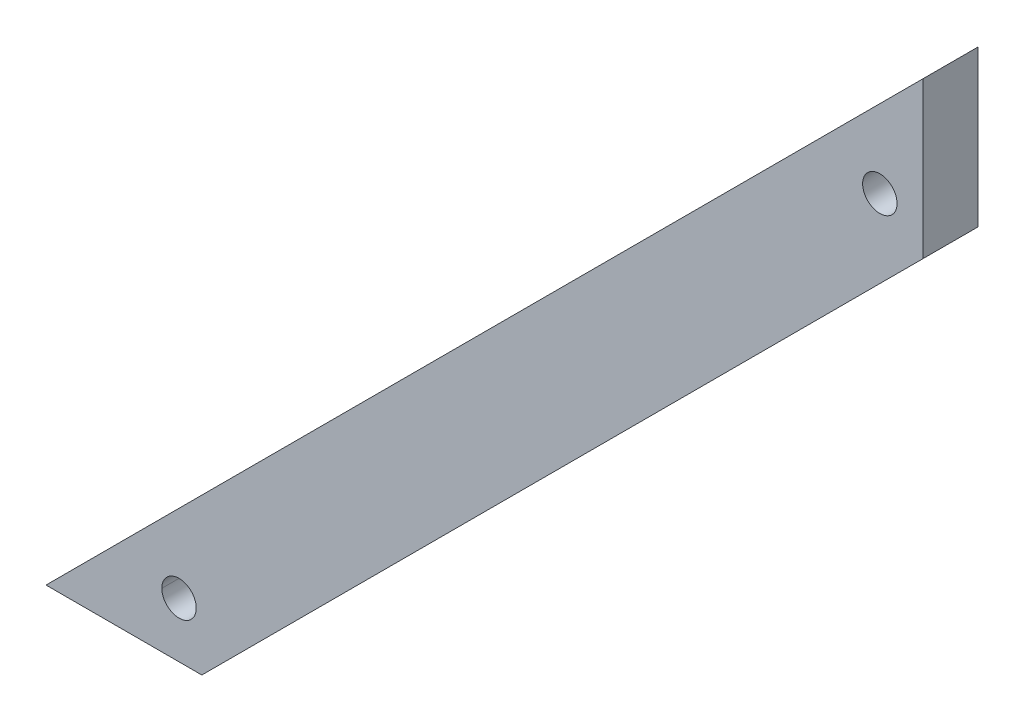
ISO-10303-21;
HEADER;
FILE_DESCRIPTION(('STEP AP214'),'2;1');
FILE_NAME('part.step','',(''),(''),'','','');
FILE_SCHEMA(('AUTOMOTIVE_DESIGN { 1 0 10303 214 1 1 1 1 }'));
ENDSEC;
DATA;
#1=APPLICATION_CONTEXT('core data for automotive mechanical design processes');
#2=APPLICATION_PROTOCOL_DEFINITION('international standard','automotive_design',2000,#1);
#3=PRODUCT_CONTEXT('',#1,'mechanical');
#4=PRODUCT('Part','Part','',(#3));
#5=PRODUCT_RELATED_PRODUCT_CATEGORY('part','',(#4));
#6=PRODUCT_DEFINITION_FORMATION('','',#4);
#7=PRODUCT_DEFINITION_CONTEXT('part definition',#1,'design');
#8=PRODUCT_DEFINITION('design','',#6,#7);
#9=PRODUCT_DEFINITION_SHAPE('','',#8);
#10=(LENGTH_UNIT() NAMED_UNIT(*) SI_UNIT(.MILLI.,.METRE.));
#11=(NAMED_UNIT(*) PLANE_ANGLE_UNIT() SI_UNIT($,.RADIAN.));
#12=(NAMED_UNIT(*) SI_UNIT($,.STERADIAN.) SOLID_ANGLE_UNIT());
#13=UNCERTAINTY_MEASURE_WITH_UNIT(LENGTH_MEASURE(1.E-05),#10,'distance_accuracy_value','');
#14=(GEOMETRIC_REPRESENTATION_CONTEXT(3) GLOBAL_UNCERTAINTY_ASSIGNED_CONTEXT((#13)) GLOBAL_UNIT_ASSIGNED_CONTEXT((#10,
#11,#12)) REPRESENTATION_CONTEXT('',''));
#15=CARTESIAN_POINT('',(0.,0.,0.));
#16=DIRECTION('',(0.,0.,1.));
#17=DIRECTION('',(1.,0.,0.));
#18=AXIS2_PLACEMENT_3D('',#15,#16,#17);
#19=CARTESIAN_POINT('',(0.,0.,0.));
#20=DIRECTION('',(0.,0.,1.));
#21=DIRECTION('',(1.,0.,0.));
#22=AXIS2_PLACEMENT_3D('',#19,#20,#21);
#23=PLANE('',#22);
#24=CARTESIAN_POINT('',(0.7,40.7004833995939,0.));
#25=DIRECTION('',(0.,0.,1.));
#26=DIRECTION('',(1.,0.,0.));
#27=AXIS2_PLACEMENT_3D('',#24,#25,#26);
#28=CIRCLE('',#27,1.);
#29=CARTESIAN_POINT('',(1.7,40.7004833995939,0.));
#30=VERTEX_POINT('',#29);
#31=EDGE_CURVE('E211',#30,#30,#28,.T.);
#32=ORIENTED_EDGE('',*,*,#31,.T.);
#33=EDGE_LOOP('',(#32));
#34=FACE_BOUND('',#33,.T.);
#35=DIRECTION('',(-0.707106781186548,-0.707106781186548,0.));
#36=VECTOR('',#35,1.);
#37=CARTESIAN_POINT('',(-2.89716883251381,41.6283145670801,0.));
#38=LINE('',#37,#36);
#39=CARTESIAN_POINT('',(-2.89716883251381,41.6283145670801,0.));
#40=VERTEX_POINT('',#39);
#41=CARTESIAN_POINT('',(-41.6283145670801,2.89716883251381,0.));
#42=VERTEX_POINT('',#41);
#43=EDGE_CURVE('E70',#40,#42,#38,.T.);
#44=ORIENTED_EDGE('',*,*,#43,.F.);
#45=DIRECTION('',(-0.707106781186547,-0.707106781186548,0.));
#46=VECTOR('',#45,1.);
#47=CARTESIAN_POINT('',(3.2,47.7254833995939,0.));
#48=LINE('',#47,#46);
#49=CARTESIAN_POINT('',(3.2,47.7254833995939,0.));
#50=VERTEX_POINT('',#49);
#51=EDGE_CURVE('E79',#50,#40,#48,.T.);
#52=ORIENTED_EDGE('',*,*,#51,.F.);
#53=DIRECTION('',(0.,1.,0.));
#54=VECTOR('',#53,1.);
#55=CARTESIAN_POINT('',(3.2,38.6754833995939,0.));
#56=LINE('',#55,#54);
#57=CARTESIAN_POINT('',(3.2,38.6754833995939,0.));
#58=VERTEX_POINT('',#57);
#59=EDGE_CURVE('E186',#58,#50,#56,.T.);
#60=ORIENTED_EDGE('',*,*,#59,.F.);
#61=DIRECTION('',(0.707106781186548,0.707106781186548,0.));
#62=VECTOR('',#61,1.);
#63=CARTESIAN_POINT('',(-38.6754833995939,-3.2,0.));
#64=LINE('',#63,#62);
#65=CARTESIAN_POINT('',(-38.6754833995939,-3.2,0.));
#66=VERTEX_POINT('',#65);
#67=EDGE_CURVE('E169',#66,#58,#64,.T.);
#68=ORIENTED_EDGE('',*,*,#67,.F.);
#69=DIRECTION('',(1.,0.,0.));
#70=VECTOR('',#69,1.);
#71=CARTESIAN_POINT('',(-47.7254833995939,-3.2,0.));
#72=LINE('',#71,#70);
#73=CARTESIAN_POINT('',(-47.7254833995939,-3.2,0.));
#74=VERTEX_POINT('',#73);
#75=EDGE_CURVE('E120',#74,#66,#72,.T.);
#76=ORIENTED_EDGE('',*,*,#75,.F.);
#77=DIRECTION('',(-0.707106781186548,-0.707106781186548,0.));
#78=VECTOR('',#77,1.);
#79=CARTESIAN_POINT('',(-41.6283145670801,2.89716883251381,0.));
#80=LINE('',#79,#78);
#81=EDGE_CURVE('E114',#42,#74,#80,.T.);
#82=ORIENTED_EDGE('',*,*,#81,.F.);
#83=EDGE_LOOP('',(#44,#52,#60,#68,#76,#82));
#84=FACE_BOUND('',#83,.T.);
#85=CARTESIAN_POINT('',(-40.,0.,0.));
#86=DIRECTION('',(0.,0.,-1.));
#87=DIRECTION('',(-1.,0.,0.));
#88=AXIS2_PLACEMENT_3D('',#85,#86,#87);
#89=CIRCLE('',#88,1.);
#90=CARTESIAN_POINT('',(-41.,0.,0.));
#91=VERTEX_POINT('',#90);
#92=CARTESIAN_POINT('',(-39.,0.,0.));
#93=VERTEX_POINT('',#92);
#94=EDGE_CURVE('E63',#91,#93,#89,.T.);
#95=ORIENTED_EDGE('',*,*,#94,.F.);
#96=CARTESIAN_POINT('',(-40.,0.,0.));
#97=DIRECTION('',(0.,0.,-1.));
#98=DIRECTION('',(1.,0.,0.));
#99=AXIS2_PLACEMENT_3D('',#96,#97,#98);
#100=CIRCLE('',#99,1.);
#101=EDGE_CURVE('E132',#93,#91,#100,.T.);
#102=ORIENTED_EDGE('',*,*,#101,.F.);
#103=EDGE_LOOP('',(#95,#102));
#104=FACE_BOUND('',#103,.T.);
#105=ADVANCED_FACE('F60',(#34,#84,#104),#23,.F.);
#106=CARTESIAN_POINT('',(-2.89716883251381,41.6283145670801,0.));
#107=DIRECTION('',(-0.707106781186548,0.707106781186548,0.));
#108=DIRECTION('',(-0.707106781186548,-0.707106781186548,0.));
#109=AXIS2_PLACEMENT_3D('',#106,#107,#108);
#110=PLANE('',#109);
#111=DIRECTION('',(0.,0.,1.));
#112=VECTOR('',#111,1.);
#113=CARTESIAN_POINT('',(-41.6283145670801,2.89716883251382,0.));
#114=LINE('',#113,#112);
#115=CARTESIAN_POINT('',(-41.6283145670801,2.89716883251381,3.2));
#116=VERTEX_POINT('',#115);
#117=EDGE_CURVE('E12',#42,#116,#114,.T.);
#118=ORIENTED_EDGE('',*,*,#117,.T.);
#119=DIRECTION('',(-0.707106781186548,-0.707106781186548,0.));
#120=VECTOR('',#119,1.);
#121=CARTESIAN_POINT('',(-2.89716883251381,41.6283145670801,3.2));
#122=LINE('',#121,#120);
#123=CARTESIAN_POINT('',(-2.89716883251381,41.6283145670801,3.2));
#124=VERTEX_POINT('',#123);
#125=EDGE_CURVE('E161',#124,#116,#122,.T.);
#126=ORIENTED_EDGE('',*,*,#125,.F.);
#127=DIRECTION('',(0.,0.,1.));
#128=VECTOR('',#127,1.);
#129=CARTESIAN_POINT('',(-2.89716883251381,41.6283145670801,0.));
#130=LINE('',#129,#128);
#131=EDGE_CURVE('E182',#40,#124,#130,.T.);
#132=ORIENTED_EDGE('',*,*,#131,.F.);
#133=ORIENTED_EDGE('',*,*,#43,.T.);
#134=EDGE_LOOP('',(#118,#126,#132,#133));
#135=FACE_BOUND('',#134,.T.);
#136=ADVANCED_FACE('F225',(#135),#110,.T.);
#137=CARTESIAN_POINT('',(3.2,47.7254833995939,0.));
#138=DIRECTION('',(-0.707106781186548,0.707106781186548,0.));
#139=DIRECTION('',(-0.707106781186548,-0.707106781186548,0.));
#140=AXIS2_PLACEMENT_3D('',#137,#138,#139);
#141=PLANE('',#140);
#142=ORIENTED_EDGE('',*,*,#131,.T.);
#143=DIRECTION('',(-0.707106781186547,-0.707106781186548,0.));
#144=VECTOR('',#143,1.);
#145=CARTESIAN_POINT('',(3.2,47.7254833995939,3.2));
#146=LINE('',#145,#144);
#147=CARTESIAN_POINT('',(3.2,47.7254833995939,3.2));
#148=VERTEX_POINT('',#147);
#149=EDGE_CURVE('E164',#148,#124,#146,.T.);
#150=ORIENTED_EDGE('',*,*,#149,.F.);
#151=DIRECTION('',(0.,0.,1.));
#152=VECTOR('',#151,1.);
#153=CARTESIAN_POINT('',(3.2,47.7254833995939,0.));
#154=LINE('',#153,#152);
#155=EDGE_CURVE('E183',#50,#148,#154,.T.);
#156=ORIENTED_EDGE('',*,*,#155,.F.);
#157=ORIENTED_EDGE('',*,*,#51,.T.);
#158=EDGE_LOOP('',(#142,#150,#156,#157));
#159=FACE_BOUND('',#158,.T.);
#160=ADVANCED_FACE('F258',(#159),#141,.T.);
#161=CARTESIAN_POINT('',(3.2,38.6754833995939,0.));
#162=DIRECTION('',(1.,0.,0.));
#163=DIRECTION('',(0.,1.,0.));
#164=AXIS2_PLACEMENT_3D('',#161,#162,#163);
#165=PLANE('',#164);
#166=ORIENTED_EDGE('',*,*,#155,.T.);
#167=DIRECTION('',(0.,1.,0.));
#168=VECTOR('',#167,1.);
#169=CARTESIAN_POINT('',(3.2,38.6754833995939,3.2));
#170=LINE('',#169,#168);
#171=CARTESIAN_POINT('',(3.2,38.6754833995939,3.2));
#172=VERTEX_POINT('',#171);
#173=EDGE_CURVE('E168',#172,#148,#170,.T.);
#174=ORIENTED_EDGE('',*,*,#173,.F.);
#175=DIRECTION('',(0.,0.,1.));
#176=VECTOR('',#175,1.);
#177=CARTESIAN_POINT('',(3.2,38.6754833995939,0.));
#178=LINE('',#177,#176);
#179=EDGE_CURVE('E172',#58,#172,#178,.T.);
#180=ORIENTED_EDGE('',*,*,#179,.F.);
#181=ORIENTED_EDGE('',*,*,#59,.T.);
#182=EDGE_LOOP('',(#166,#174,#180,#181));
#183=FACE_BOUND('',#182,.T.);
#184=ADVANCED_FACE('F263',(#183),#165,.T.);
#185=CARTESIAN_POINT('',(-38.6754833995939,-3.2,0.));
#186=DIRECTION('',(0.707106781186548,-0.707106781186548,0.));
#187=DIRECTION('',(0.707106781186548,0.707106781186548,0.));
#188=AXIS2_PLACEMENT_3D('',#185,#186,#187);
#189=PLANE('',#188);
#190=ORIENTED_EDGE('',*,*,#179,.T.);
#191=DIRECTION('',(0.707106781186548,0.707106781186548,0.));
#192=VECTOR('',#191,1.);
#193=CARTESIAN_POINT('',(-38.6754833995939,-3.2,3.2));
#194=LINE('',#193,#192);
#195=CARTESIAN_POINT('',(-38.6754833995939,-3.2,3.2));
#196=VERTEX_POINT('',#195);
#197=EDGE_CURVE('E174',#196,#172,#194,.T.);
#198=ORIENTED_EDGE('',*,*,#197,.F.);
#199=DIRECTION('',(0.,0.,1.));
#200=VECTOR('',#199,1.);
#201=CARTESIAN_POINT('',(-38.6754833995939,-3.2,0.));
#202=LINE('',#201,#200);
#203=EDGE_CURVE('E173',#66,#196,#202,.T.);
#204=ORIENTED_EDGE('',*,*,#203,.F.);
#205=ORIENTED_EDGE('',*,*,#67,.T.);
#206=EDGE_LOOP('',(#190,#198,#204,#205));
#207=FACE_BOUND('',#206,.T.);
#208=ADVANCED_FACE('F266',(#207),#189,.T.);
#209=CARTESIAN_POINT('',(-47.7254833995939,-3.2,0.));
#210=DIRECTION('',(0.,-1.,0.));
#211=DIRECTION('',(1.,0.,0.));
#212=AXIS2_PLACEMENT_3D('',#209,#210,#211);
#213=PLANE('',#212);
#214=ORIENTED_EDGE('',*,*,#203,.T.);
#215=DIRECTION('',(1.,0.,0.));
#216=VECTOR('',#215,1.);
#217=CARTESIAN_POINT('',(-47.7254833995939,-3.2,3.2));
#218=LINE('',#217,#216);
#219=CARTESIAN_POINT('',(-47.7254833995939,-3.2,3.2));
#220=VERTEX_POINT('',#219);
#221=EDGE_CURVE('E140',#220,#196,#218,.T.);
#222=ORIENTED_EDGE('',*,*,#221,.F.);
#223=DIRECTION('',(0.,0.,1.));
#224=VECTOR('',#223,1.);
#225=CARTESIAN_POINT('',(-47.7254833995939,-3.2,0.));
#226=LINE('',#225,#224);
#227=EDGE_CURVE('E157',#74,#220,#226,.T.);
#228=ORIENTED_EDGE('',*,*,#227,.F.);
#229=ORIENTED_EDGE('',*,*,#75,.T.);
#230=EDGE_LOOP('',(#214,#222,#228,#229));
#231=FACE_BOUND('',#230,.T.);
#232=ADVANCED_FACE('F227',(#231),#213,.T.);
#233=CARTESIAN_POINT('',(-41.6283145670801,2.89716883251381,0.));
#234=DIRECTION('',(-0.707106781186548,0.707106781186548,0.));
#235=DIRECTION('',(-0.707106781186548,-0.707106781186548,0.));
#236=AXIS2_PLACEMENT_3D('',#233,#234,#235);
#237=PLANE('',#236);
#238=ORIENTED_EDGE('',*,*,#227,.T.);
#239=DIRECTION('',(-0.707106781186548,-0.707106781186548,0.));
#240=VECTOR('',#239,1.);
#241=CARTESIAN_POINT('',(-41.6283145670801,2.89716883251381,3.2));
#242=LINE('',#241,#240);
#243=EDGE_CURVE('E191',#116,#220,#242,.T.);
#244=ORIENTED_EDGE('',*,*,#243,.F.);
#245=ORIENTED_EDGE('',*,*,#117,.F.);
#246=ORIENTED_EDGE('',*,*,#81,.T.);
#247=EDGE_LOOP('',(#238,#244,#245,#246));
#248=FACE_BOUND('',#247,.T.);
#249=ADVANCED_FACE('F226',(#248),#237,.T.);
#250=CARTESIAN_POINT('',(-40.,0.,0.));
#251=DIRECTION('',(0.,0.,-1.));
#252=DIRECTION('',(1.,0.,0.));
#253=AXIS2_PLACEMENT_3D('',#250,#251,#252);
#254=CYLINDRICAL_SURFACE('',#253,1.);
#255=DIRECTION('',(0.,0.,1.));
#256=VECTOR('',#255,1.);
#257=CARTESIAN_POINT('',(-39.,0.,0.));
#258=LINE('',#257,#256);
#259=CARTESIAN_POINT('',(-39.,0.,3.2));
#260=VERTEX_POINT('',#259);
#261=EDGE_CURVE('E145',#93,#260,#258,.T.);
#262=ORIENTED_EDGE('',*,*,#261,.T.);
#263=CARTESIAN_POINT('',(-40.,0.,3.2));
#264=DIRECTION('',(0.,0.,-1.));
#265=DIRECTION('',(-1.,0.,0.));
#266=AXIS2_PLACEMENT_3D('',#263,#264,#265);
#267=CIRCLE('',#266,1.);
#268=CARTESIAN_POINT('',(-41.,0.,3.2));
#269=VERTEX_POINT('',#268);
#270=EDGE_CURVE('E189',#269,#260,#267,.T.);
#271=ORIENTED_EDGE('',*,*,#270,.F.);
#272=DIRECTION('',(0.,0.,1.));
#273=VECTOR('',#272,1.);
#274=CARTESIAN_POINT('',(-41.,0.,0.));
#275=LINE('',#274,#273);
#276=EDGE_CURVE('E139',#91,#269,#275,.T.);
#277=ORIENTED_EDGE('',*,*,#276,.F.);
#278=ORIENTED_EDGE('',*,*,#94,.T.);
#279=EDGE_LOOP('',(#262,#271,#277,#278));
#280=FACE_BOUND('',#279,.T.);
#281=ADVANCED_FACE('F144',(#280),#254,.F.);
#282=CARTESIAN_POINT('',(-40.,0.,0.));
#283=DIRECTION('',(0.,0.,-1.));
#284=DIRECTION('',(1.,0.,0.));
#285=AXIS2_PLACEMENT_3D('',#282,#283,#284);
#286=CYLINDRICAL_SURFACE('',#285,1.);
#287=ORIENTED_EDGE('',*,*,#276,.T.);
#288=CARTESIAN_POINT('',(-40.,0.,3.2));
#289=DIRECTION('',(0.,0.,-1.));
#290=DIRECTION('',(1.,0.,0.));
#291=AXIS2_PLACEMENT_3D('',#288,#289,#290);
#292=CIRCLE('',#291,1.);
#293=EDGE_CURVE('E150',#260,#269,#292,.T.);
#294=ORIENTED_EDGE('',*,*,#293,.F.);
#295=ORIENTED_EDGE('',*,*,#261,.F.);
#296=ORIENTED_EDGE('',*,*,#101,.T.);
#297=EDGE_LOOP('',(#287,#294,#295,#296));
#298=FACE_BOUND('',#297,.T.);
#299=ADVANCED_FACE('F148',(#298),#286,.F.);
#300=CARTESIAN_POINT('',(0.,0.,3.2));
#301=DIRECTION('',(0.,0.,1.));
#302=DIRECTION('',(1.,0.,0.));
#303=AXIS2_PLACEMENT_3D('',#300,#301,#302);
#304=PLANE('',#303);
#305=CARTESIAN_POINT('',(0.7,40.7004833995939,3.2));
#306=DIRECTION('',(0.,0.,1.));
#307=DIRECTION('',(1.,0.,0.));
#308=AXIS2_PLACEMENT_3D('',#305,#306,#307);
#309=CIRCLE('',#308,1.);
#310=CARTESIAN_POINT('',(1.7,40.7004833995939,3.2));
#311=VERTEX_POINT('',#310);
#312=EDGE_CURVE('E234',#311,#311,#309,.T.);
#313=ORIENTED_EDGE('',*,*,#312,.F.);
#314=EDGE_LOOP('',(#313));
#315=FACE_BOUND('',#314,.T.);
#316=ORIENTED_EDGE('',*,*,#221,.T.);
#317=ORIENTED_EDGE('',*,*,#197,.T.);
#318=ORIENTED_EDGE('',*,*,#173,.T.);
#319=ORIENTED_EDGE('',*,*,#149,.T.);
#320=ORIENTED_EDGE('',*,*,#125,.T.);
#321=ORIENTED_EDGE('',*,*,#243,.T.);
#322=EDGE_LOOP('',(#316,#317,#318,#319,#320,#321));
#323=FACE_BOUND('',#322,.T.);
#324=ORIENTED_EDGE('',*,*,#270,.T.);
#325=ORIENTED_EDGE('',*,*,#293,.T.);
#326=EDGE_LOOP('',(#324,#325));
#327=FACE_BOUND('',#326,.T.);
#328=ADVANCED_FACE('F222',(#315,#323,#327),#304,.T.);
#329=CARTESIAN_POINT('',(0.7,40.7004833995939,0.));
#330=DIRECTION('',(0.,0.,1.));
#331=DIRECTION('',(1.,0.,0.));
#332=AXIS2_PLACEMENT_3D('',#329,#330,#331);
#333=CYLINDRICAL_SURFACE('',#332,1.);
#334=ORIENTED_EDGE('',*,*,#31,.F.);
#335=EDGE_LOOP('',(#334));
#336=FACE_BOUND('',#335,.T.);
#337=ORIENTED_EDGE('',*,*,#312,.T.);
#338=EDGE_LOOP('',(#337));
#339=FACE_BOUND('',#338,.T.);
#340=ADVANCED_FACE('F242',(#336,#339),#333,.F.);
#341=CLOSED_SHELL('',(#105,#136,#160,#184,#208,#232,#249,#281,#299,#328,#340));
#342=MANIFOLD_SOLID_BREP('B2',#341);
#343=ADVANCED_BREP_SHAPE_REPRESENTATION('',(#18,#342),#14);
#344=SHAPE_DEFINITION_REPRESENTATION(#9,#343);
ENDSEC;
END-ISO-10303-21;
